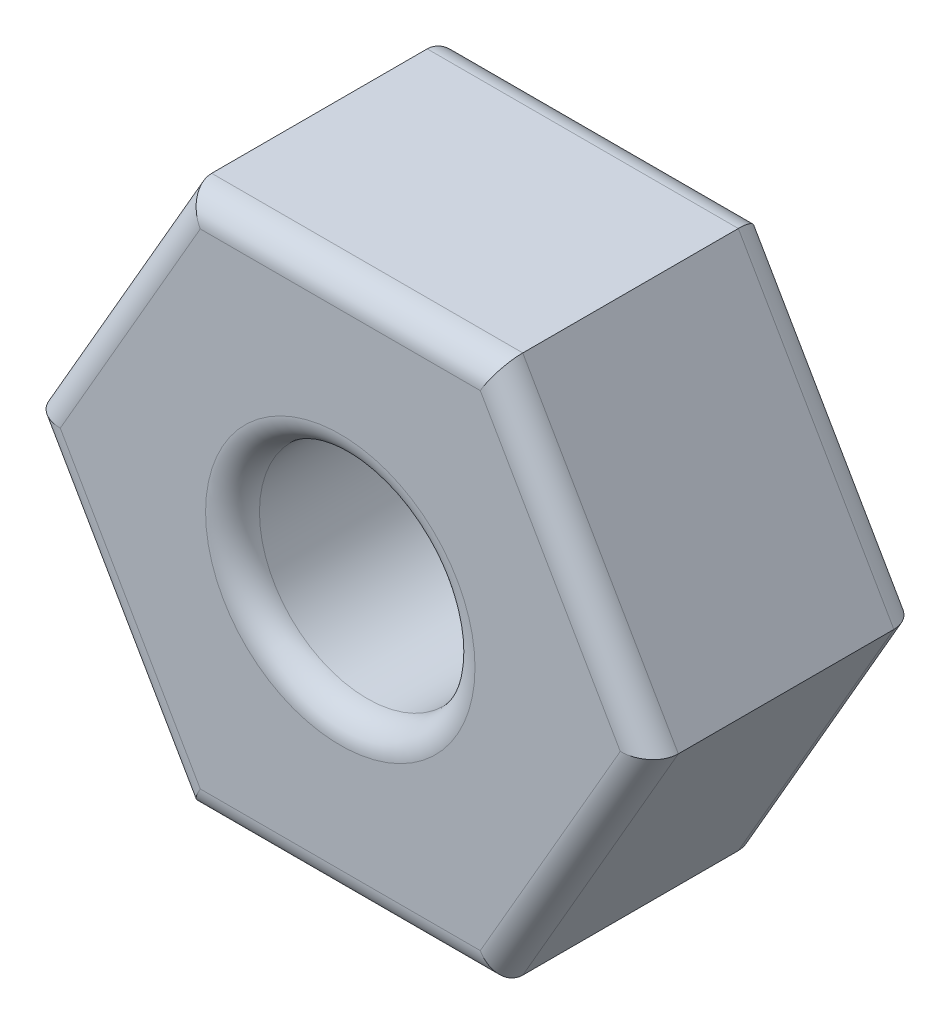
ISO-10303-21;
HEADER;
FILE_DESCRIPTION(('STEP AP214'),'2;1');
FILE_NAME('part.step','',(''),(''),'','','');
FILE_SCHEMA(('AUTOMOTIVE_DESIGN { 1 0 10303 214 1 1 1 1 }'));
ENDSEC;
DATA;
#1=APPLICATION_CONTEXT('core data for automotive mechanical design processes');
#2=APPLICATION_PROTOCOL_DEFINITION('international standard','automotive_design',2000,#1);
#3=PRODUCT_CONTEXT('',#1,'mechanical');
#4=PRODUCT('Part','Part','',(#3));
#5=PRODUCT_RELATED_PRODUCT_CATEGORY('part','',(#4));
#6=PRODUCT_DEFINITION_FORMATION('','',#4);
#7=PRODUCT_DEFINITION_CONTEXT('part definition',#1,'design');
#8=PRODUCT_DEFINITION('design','',#6,#7);
#9=PRODUCT_DEFINITION_SHAPE('','',#8);
#10=(LENGTH_UNIT() NAMED_UNIT(*) SI_UNIT(.MILLI.,.METRE.));
#11=(NAMED_UNIT(*) PLANE_ANGLE_UNIT() SI_UNIT($,.RADIAN.));
#12=(NAMED_UNIT(*) SI_UNIT($,.STERADIAN.) SOLID_ANGLE_UNIT());
#13=UNCERTAINTY_MEASURE_WITH_UNIT(LENGTH_MEASURE(1.E-05),#10,'distance_accuracy_value','');
#14=(GEOMETRIC_REPRESENTATION_CONTEXT(3) GLOBAL_UNCERTAINTY_ASSIGNED_CONTEXT((#13)) GLOBAL_UNIT_ASSIGNED_CONTEXT((#10,
#11,#12)) REPRESENTATION_CONTEXT('',''));
#15=CARTESIAN_POINT('',(0.,0.,0.));
#16=DIRECTION('',(0.,0.,1.));
#17=DIRECTION('',(1.,0.,0.));
#18=AXIS2_PLACEMENT_3D('',#15,#16,#17);
#19=CARTESIAN_POINT('',(0.,0.,2.));
#20=DIRECTION('',(0.,0.,1.));
#21=DIRECTION('',(1.,0.,0.));
#22=AXIS2_PLACEMENT_3D('',#19,#20,#21);
#23=PLANE('',#22);
#24=CARTESIAN_POINT('',(0.,0.,2.));
#25=DIRECTION('',(0.,0.,1.));
#26=DIRECTION('',(1.,0.,0.));
#27=AXIS2_PLACEMENT_3D('',#24,#25,#26);
#28=CIRCLE('',#27,1.);
#29=CARTESIAN_POINT('',(1.,0.,2.));
#30=VERTEX_POINT('',#29);
#31=EDGE_CURVE('E11',#30,#30,#28,.F.);
#32=ORIENTED_EDGE('',*,*,#31,.T.);
#33=EDGE_LOOP('',(#32));
#34=FACE_BOUND('',#33,.T.);
#35=DIRECTION('',(0.5,-0.866025403784439,0.));
#36=VECTOR('',#35,1.);
#37=CARTESIAN_POINT('',(-0.981495457622361,-1.9,2.));
#38=LINE('',#37,#36);
#39=CARTESIAN_POINT('',(-2.07846096908265,0.,2.));
#40=VERTEX_POINT('',#39);
#41=CARTESIAN_POINT('',(-1.03923048454132,-1.8,2.));
#42=VERTEX_POINT('',#41);
#43=EDGE_CURVE('E52',#40,#42,#38,.T.);
#44=ORIENTED_EDGE('',*,*,#43,.T.);
#45=DIRECTION('',(1.,0.,0.));
#46=VECTOR('',#45,1.);
#47=CARTESIAN_POINT('',(1.15470053837925,-1.8,2.));
#48=LINE('',#47,#46);
#49=CARTESIAN_POINT('',(1.03923048454133,-1.8,2.));
#50=VERTEX_POINT('',#49);
#51=EDGE_CURVE('E44',#42,#50,#48,.T.);
#52=ORIENTED_EDGE('',*,*,#51,.T.);
#53=DIRECTION('',(0.499999999999999,0.866025403784439,0.));
#54=VECTOR('',#53,1.);
#55=CARTESIAN_POINT('',(2.13619599600162,0.100000000000002,2.));
#56=LINE('',#55,#54);
#57=CARTESIAN_POINT('',(2.07846096908265,0.,2.));
#58=VERTEX_POINT('',#57);
#59=EDGE_CURVE('E191',#50,#58,#56,.T.);
#60=ORIENTED_EDGE('',*,*,#59,.T.);
#61=DIRECTION('',(-0.5,0.866025403784439,0.));
#62=VECTOR('',#61,1.);
#63=CARTESIAN_POINT('',(0.981495457622363,1.9,2.));
#64=LINE('',#63,#62);
#65=CARTESIAN_POINT('',(1.03923048454133,1.8,2.));
#66=VERTEX_POINT('',#65);
#67=EDGE_CURVE('E193',#58,#66,#64,.T.);
#68=ORIENTED_EDGE('',*,*,#67,.T.);
#69=DIRECTION('',(-1.,0.,0.));
#70=VECTOR('',#69,1.);
#71=CARTESIAN_POINT('',(-1.15470053837925,1.8,2.));
#72=LINE('',#71,#70);
#73=CARTESIAN_POINT('',(-1.03923048454133,1.8,2.));
#74=VERTEX_POINT('',#73);
#75=EDGE_CURVE('E195',#66,#74,#72,.T.);
#76=ORIENTED_EDGE('',*,*,#75,.T.);
#77=DIRECTION('',(-0.5,-0.866025403784439,0.));
#78=VECTOR('',#77,1.);
#79=CARTESIAN_POINT('',(-2.13619599600161,-0.100000000000001,2.));
#80=LINE('',#79,#78);
#81=EDGE_CURVE('E57',#74,#40,#80,.T.);
#82=ORIENTED_EDGE('',*,*,#81,.T.);
#83=EDGE_LOOP('',(#44,#52,#60,#68,#76,#82));
#84=FACE_BOUND('',#83,.T.);
#85=ADVANCED_FACE('F35',(#34,#84),#23,.T.);
#86=CARTESIAN_POINT('',(0.,0.,0.));
#87=DIRECTION('',(0.,0.,1.));
#88=DIRECTION('',(1.,0.,0.));
#89=AXIS2_PLACEMENT_3D('',#86,#87,#88);
#90=PLANE('',#89);
#91=CARTESIAN_POINT('',(0.,0.,0.));
#92=DIRECTION('',(0.,0.,1.));
#93=DIRECTION('',(1.,0.,0.));
#94=AXIS2_PLACEMENT_3D('',#91,#92,#93);
#95=CIRCLE('',#94,1.);
#96=CARTESIAN_POINT('',(1.,0.,0.));
#97=VERTEX_POINT('',#96);
#98=EDGE_CURVE('E153',#97,#97,#95,.T.);
#99=ORIENTED_EDGE('',*,*,#98,.T.);
#100=EDGE_LOOP('',(#99));
#101=FACE_BOUND('',#100,.T.);
#102=DIRECTION('',(-1.,0.,0.));
#103=VECTOR('',#102,1.);
#104=CARTESIAN_POINT('',(0.,1.8,0.));
#105=LINE('',#104,#103);
#106=CARTESIAN_POINT('',(-1.03923048454133,1.8,0.));
#107=VERTEX_POINT('',#106);
#108=CARTESIAN_POINT('',(1.03923048454133,1.8,0.));
#109=VERTEX_POINT('',#108);
#110=EDGE_CURVE('E152',#107,#109,#105,.F.);
#111=ORIENTED_EDGE('',*,*,#110,.T.);
#112=DIRECTION('',(-0.5,0.866025403784439,0.));
#113=VECTOR('',#112,1.);
#114=CARTESIAN_POINT('',(1.55884572681199,0.900000000000001,0.));
#115=LINE('',#114,#113);
#116=CARTESIAN_POINT('',(2.07846096908265,0.,0.));
#117=VERTEX_POINT('',#116);
#118=EDGE_CURVE('E131',#109,#117,#115,.F.);
#119=ORIENTED_EDGE('',*,*,#118,.T.);
#120=DIRECTION('',(0.499999999999999,0.866025403784439,0.));
#121=VECTOR('',#120,1.);
#122=CARTESIAN_POINT('',(1.55884572681199,-0.899999999999999,0.));
#123=LINE('',#122,#121);
#124=CARTESIAN_POINT('',(1.03923048454133,-1.8,0.));
#125=VERTEX_POINT('',#124);
#126=EDGE_CURVE('E141',#117,#125,#123,.F.);
#127=ORIENTED_EDGE('',*,*,#126,.T.);
#128=DIRECTION('',(1.,0.,0.));
#129=VECTOR('',#128,1.);
#130=CARTESIAN_POINT('',(0.,-1.8,0.));
#131=LINE('',#130,#129);
#132=CARTESIAN_POINT('',(-1.03923048454132,-1.8,0.));
#133=VERTEX_POINT('',#132);
#134=EDGE_CURVE('E147',#125,#133,#131,.F.);
#135=ORIENTED_EDGE('',*,*,#134,.T.);
#136=DIRECTION('',(0.5,-0.866025403784439,0.));
#137=VECTOR('',#136,1.);
#138=CARTESIAN_POINT('',(-1.55884572681199,-0.9,0.));
#139=LINE('',#138,#137);
#140=CARTESIAN_POINT('',(-2.07846096908265,0.,0.));
#141=VERTEX_POINT('',#140);
#142=EDGE_CURVE('E253',#133,#141,#139,.F.);
#143=ORIENTED_EDGE('',*,*,#142,.T.);
#144=DIRECTION('',(-0.5,-0.866025403784439,0.));
#145=VECTOR('',#144,1.);
#146=CARTESIAN_POINT('',(-1.55884572681199,0.899999999999998,0.));
#147=LINE('',#146,#145);
#148=EDGE_CURVE('E158',#141,#107,#147,.F.);
#149=ORIENTED_EDGE('',*,*,#148,.T.);
#150=EDGE_LOOP('',(#111,#119,#127,#135,#143,#149));
#151=FACE_BOUND('',#150,.T.);
#152=ADVANCED_FACE('F150',(#101,#151),#90,.F.);
#153=CARTESIAN_POINT('',(1.15470053837925,-2.,2.));
#154=DIRECTION('',(-0.866025403784439,0.5,0.));
#155=DIRECTION('',(-0.499999999999999,-0.866025403784439,0.));
#156=AXIS2_PLACEMENT_3D('',#153,#154,#155);
#157=PLANE('',#156);
#158=DIRECTION('',(0.,0.,-1.));
#159=VECTOR('',#158,1.);
#160=CARTESIAN_POINT('',(1.15470053837925,-2.,2.));
#161=LINE('',#160,#159);
#162=CARTESIAN_POINT('',(1.15470053837925,-2.,1.8));
#163=VERTEX_POINT('',#162);
#164=CARTESIAN_POINT('',(1.15470053837925,-2.,0.2));
#165=VERTEX_POINT('',#164);
#166=EDGE_CURVE('E210',#163,#165,#161,.T.);
#167=ORIENTED_EDGE('',*,*,#166,.T.);
#168=DIRECTION('',(0.499999999999999,0.866025403784439,0.));
#169=VECTOR('',#168,1.);
#170=CARTESIAN_POINT('',(1.15470053837925,-2.,0.2));
#171=LINE('',#170,#169);
#172=CARTESIAN_POINT('',(2.3094010767585,0.,0.2));
#173=VERTEX_POINT('',#172);
#174=EDGE_CURVE('E189',#165,#173,#171,.T.);
#175=ORIENTED_EDGE('',*,*,#174,.T.);
#176=DIRECTION('',(0.,0.,-1.));
#177=VECTOR('',#176,1.);
#178=CARTESIAN_POINT('',(2.3094010767585,0.,2.));
#179=LINE('',#178,#177);
#180=CARTESIAN_POINT('',(2.3094010767585,0.,1.8));
#181=VERTEX_POINT('',#180);
#182=EDGE_CURVE('E148',#181,#173,#179,.T.);
#183=ORIENTED_EDGE('',*,*,#182,.F.);
#184=DIRECTION('',(0.499999999999999,0.866025403784439,0.));
#185=VECTOR('',#184,1.);
#186=CARTESIAN_POINT('',(1.15470053837925,-2.,1.8));
#187=LINE('',#186,#185);
#188=EDGE_CURVE('E187',#181,#163,#187,.F.);
#189=ORIENTED_EDGE('',*,*,#188,.T.);
#190=EDGE_LOOP('',(#167,#175,#183,#189));
#191=FACE_BOUND('',#190,.T.);
#192=ADVANCED_FACE('F277',(#191),#157,.F.);
#193=CARTESIAN_POINT('',(2.3094010767585,0.,2.));
#194=DIRECTION('',(-0.866025403784438,-0.5,0.));
#195=DIRECTION('',(0.5,-0.866025403784439,0.));
#196=AXIS2_PLACEMENT_3D('',#193,#194,#195);
#197=PLANE('',#196);
#198=ORIENTED_EDGE('',*,*,#182,.T.);
#199=DIRECTION('',(-0.5,0.866025403784439,0.));
#200=VECTOR('',#199,1.);
#201=CARTESIAN_POINT('',(2.3094010767585,0.,0.2));
#202=LINE('',#201,#200);
#203=CARTESIAN_POINT('',(1.15470053837925,2.,0.2));
#204=VERTEX_POINT('',#203);
#205=EDGE_CURVE('E134',#173,#204,#202,.T.);
#206=ORIENTED_EDGE('',*,*,#205,.T.);
#207=DIRECTION('',(0.,0.,-1.));
#208=VECTOR('',#207,1.);
#209=CARTESIAN_POINT('',(1.15470053837925,2.,2.));
#210=LINE('',#209,#208);
#211=CARTESIAN_POINT('',(1.15470053837925,2.,1.8));
#212=VERTEX_POINT('',#211);
#213=EDGE_CURVE('E239',#212,#204,#210,.T.);
#214=ORIENTED_EDGE('',*,*,#213,.F.);
#215=DIRECTION('',(-0.5,0.866025403784439,0.));
#216=VECTOR('',#215,1.);
#217=CARTESIAN_POINT('',(2.3094010767585,0.,1.8));
#218=LINE('',#217,#216);
#219=EDGE_CURVE('E167',#212,#181,#218,.F.);
#220=ORIENTED_EDGE('',*,*,#219,.T.);
#221=EDGE_LOOP('',(#198,#206,#214,#220));
#222=FACE_BOUND('',#221,.T.);
#223=ADVANCED_FACE('F244',(#222),#197,.F.);
#224=CARTESIAN_POINT('',(1.15470053837925,2.,2.));
#225=DIRECTION('',(0.,-1.,0.));
#226=DIRECTION('',(1.,0.,0.));
#227=AXIS2_PLACEMENT_3D('',#224,#225,#226);
#228=PLANE('',#227);
#229=ORIENTED_EDGE('',*,*,#213,.T.);
#230=DIRECTION('',(-1.,0.,0.));
#231=VECTOR('',#230,1.);
#232=CARTESIAN_POINT('',(1.15470053837925,2.,0.2));
#233=LINE('',#232,#231);
#234=CARTESIAN_POINT('',(-1.15470053837925,2.,0.2));
#235=VERTEX_POINT('',#234);
#236=EDGE_CURVE('E172',#204,#235,#233,.T.);
#237=ORIENTED_EDGE('',*,*,#236,.T.);
#238=DIRECTION('',(0.,0.,-1.));
#239=VECTOR('',#238,1.);
#240=CARTESIAN_POINT('',(-1.15470053837925,2.,2.));
#241=LINE('',#240,#239);
#242=CARTESIAN_POINT('',(-1.15470053837925,2.,1.8));
#243=VERTEX_POINT('',#242);
#244=EDGE_CURVE('E241',#243,#235,#241,.T.);
#245=ORIENTED_EDGE('',*,*,#244,.F.);
#246=DIRECTION('',(-1.,0.,0.));
#247=VECTOR('',#246,1.);
#248=CARTESIAN_POINT('',(1.15470053837925,2.,1.8));
#249=LINE('',#248,#247);
#250=EDGE_CURVE('E170',#243,#212,#249,.F.);
#251=ORIENTED_EDGE('',*,*,#250,.T.);
#252=EDGE_LOOP('',(#229,#237,#245,#251));
#253=FACE_BOUND('',#252,.T.);
#254=ADVANCED_FACE('F238',(#253),#228,.F.);
#255=CARTESIAN_POINT('',(-1.15470053837925,2.,2.));
#256=DIRECTION('',(0.866025403784439,-0.499999999999999,0.));
#257=DIRECTION('',(0.5,0.866025403784439,0.));
#258=AXIS2_PLACEMENT_3D('',#255,#256,#257);
#259=PLANE('',#258);
#260=ORIENTED_EDGE('',*,*,#244,.T.);
#261=DIRECTION('',(-0.5,-0.866025403784439,0.));
#262=VECTOR('',#261,1.);
#263=CARTESIAN_POINT('',(-1.15470053837925,2.,0.2));
#264=LINE('',#263,#262);
#265=CARTESIAN_POINT('',(-2.3094010767585,0.,0.2));
#266=VERTEX_POINT('',#265);
#267=EDGE_CURVE('E176',#235,#266,#264,.T.);
#268=ORIENTED_EDGE('',*,*,#267,.T.);
#269=DIRECTION('',(0.,0.,-1.));
#270=VECTOR('',#269,1.);
#271=CARTESIAN_POINT('',(-2.3094010767585,0.,2.));
#272=LINE('',#271,#270);
#273=CARTESIAN_POINT('',(-2.3094010767585,0.,1.8));
#274=VERTEX_POINT('',#273);
#275=EDGE_CURVE('E248',#274,#266,#272,.T.);
#276=ORIENTED_EDGE('',*,*,#275,.F.);
#277=DIRECTION('',(-0.5,-0.866025403784439,0.));
#278=VECTOR('',#277,1.);
#279=CARTESIAN_POINT('',(-1.15470053837925,2.,1.8));
#280=LINE('',#279,#278);
#281=EDGE_CURVE('E174',#274,#243,#280,.F.);
#282=ORIENTED_EDGE('',*,*,#281,.T.);
#283=EDGE_LOOP('',(#260,#268,#276,#282));
#284=FACE_BOUND('',#283,.T.);
#285=ADVANCED_FACE('F265',(#284),#259,.F.);
#286=CARTESIAN_POINT('',(-2.3094010767585,0.,2.));
#287=DIRECTION('',(0.866025403784438,0.5,0.));
#288=DIRECTION('',(-0.5,0.866025403784439,0.));
#289=AXIS2_PLACEMENT_3D('',#286,#287,#288);
#290=PLANE('',#289);
#291=ORIENTED_EDGE('',*,*,#275,.T.);
#292=DIRECTION('',(0.5,-0.866025403784439,0.));
#293=VECTOR('',#292,1.);
#294=CARTESIAN_POINT('',(-2.3094010767585,0.,0.2));
#295=LINE('',#294,#293);
#296=CARTESIAN_POINT('',(-1.15470053837925,-2.,0.2));
#297=VERTEX_POINT('',#296);
#298=EDGE_CURVE('E180',#266,#297,#295,.T.);
#299=ORIENTED_EDGE('',*,*,#298,.T.);
#300=DIRECTION('',(0.,0.,-1.));
#301=VECTOR('',#300,1.);
#302=CARTESIAN_POINT('',(-1.15470053837925,-2.,2.));
#303=LINE('',#302,#301);
#304=CARTESIAN_POINT('',(-1.15470053837925,-2.,1.8));
#305=VERTEX_POINT('',#304);
#306=EDGE_CURVE('E270',#305,#297,#303,.T.);
#307=ORIENTED_EDGE('',*,*,#306,.F.);
#308=DIRECTION('',(0.5,-0.866025403784439,0.));
#309=VECTOR('',#308,1.);
#310=CARTESIAN_POINT('',(-2.3094010767585,0.,1.8));
#311=LINE('',#310,#309);
#312=EDGE_CURVE('E178',#305,#274,#311,.F.);
#313=ORIENTED_EDGE('',*,*,#312,.T.);
#314=EDGE_LOOP('',(#291,#299,#307,#313));
#315=FACE_BOUND('',#314,.T.);
#316=ADVANCED_FACE('F288',(#315),#290,.F.);
#317=CARTESIAN_POINT('',(-1.15470053837925,-2.,2.));
#318=DIRECTION('',(0.,1.,0.));
#319=DIRECTION('',(-1.,0.,0.));
#320=AXIS2_PLACEMENT_3D('',#317,#318,#319);
#321=PLANE('',#320);
#322=ORIENTED_EDGE('',*,*,#306,.T.);
#323=DIRECTION('',(1.,0.,0.));
#324=VECTOR('',#323,1.);
#325=CARTESIAN_POINT('',(-1.15470053837925,-2.,0.2));
#326=LINE('',#325,#324);
#327=EDGE_CURVE('E185',#297,#165,#326,.T.);
#328=ORIENTED_EDGE('',*,*,#327,.T.);
#329=ORIENTED_EDGE('',*,*,#166,.F.);
#330=DIRECTION('',(1.,0.,0.));
#331=VECTOR('',#330,1.);
#332=CARTESIAN_POINT('',(-1.15470053837925,-2.,1.8));
#333=LINE('',#332,#331);
#334=EDGE_CURVE('E182',#163,#305,#333,.F.);
#335=ORIENTED_EDGE('',*,*,#334,.T.);
#336=EDGE_LOOP('',(#322,#328,#329,#335));
#337=FACE_BOUND('',#336,.T.);
#338=ADVANCED_FACE('F289',(#337),#321,.F.);
#339=CARTESIAN_POINT('',(0.,0.,2.));
#340=DIRECTION('',(0.,0.,-1.));
#341=DIRECTION('',(-1.,0.,0.));
#342=AXIS2_PLACEMENT_3D('',#339,#340,#341);
#343=CYLINDRICAL_SURFACE('',#342,0.8);
#344=CARTESIAN_POINT('',(0.,0.,0.2));
#345=DIRECTION('',(0.,0.,1.));
#346=DIRECTION('',(1.,0.,0.));
#347=AXIS2_PLACEMENT_3D('',#344,#345,#346);
#348=CIRCLE('',#347,0.8);
#349=CARTESIAN_POINT('',(0.8,0.,0.2));
#350=VERTEX_POINT('',#349);
#351=EDGE_CURVE('E164',#350,#350,#348,.F.);
#352=ORIENTED_EDGE('',*,*,#351,.T.);
#353=EDGE_LOOP('',(#352));
#354=FACE_BOUND('',#353,.T.);
#355=CARTESIAN_POINT('',(0.,0.,1.8));
#356=DIRECTION('',(0.,0.,1.));
#357=DIRECTION('',(1.,0.,0.));
#358=AXIS2_PLACEMENT_3D('',#355,#356,#357);
#359=CIRCLE('',#358,0.8);
#360=CARTESIAN_POINT('',(0.8,0.,1.8));
#361=VERTEX_POINT('',#360);
#362=EDGE_CURVE('E156',#361,#361,#359,.T.);
#363=ORIENTED_EDGE('',*,*,#362,.T.);
#364=EDGE_LOOP('',(#363));
#365=FACE_BOUND('',#364,.T.);
#366=ADVANCED_FACE('F308',(#354,#365),#343,.F.);
#367=CARTESIAN_POINT('',(0.,0.,0.2));
#368=DIRECTION('',(0.,0.,1.));
#369=DIRECTION('',(1.,0.,0.));
#370=AXIS2_PLACEMENT_3D('',#367,#368,#369);
#371=TOROIDAL_SURFACE('',#370,1.,0.2);
#372=ORIENTED_EDGE('',*,*,#351,.F.);
#373=EDGE_LOOP('',(#372));
#374=FACE_BOUND('',#373,.T.);
#375=ORIENTED_EDGE('',*,*,#98,.F.);
#376=EDGE_LOOP('',(#375));
#377=FACE_BOUND('',#376,.T.);
#378=ADVANCED_FACE('F322',(#374,#377),#371,.T.);
#379=CARTESIAN_POINT('',(-2.13619599600161,0.0999999999999992,0.2));
#380=DIRECTION('',(0.5,-0.866025403784439,0.));
#381=DIRECTION('',(0.866025403784438,0.5,0.));
#382=AXIS2_PLACEMENT_3D('',#379,#380,#381);
#383=CYLINDRICAL_SURFACE('',#382,0.2);
#384=CARTESIAN_POINT('',(-2.07846096908265,0.,0.2));
#385=DIRECTION('',(0.,-1.,0.));
#386=DIRECTION('',(1.,0.,0.));
#387=AXIS2_PLACEMENT_3D('',#384,#385,#386);
#388=ELLIPSE('',#387,0.23094010767585,0.2);
#389=EDGE_CURVE('E204',#141,#266,#388,.F.);
#390=ORIENTED_EDGE('',*,*,#389,.F.);
#391=ORIENTED_EDGE('',*,*,#142,.F.);
#392=CARTESIAN_POINT('',(-1.03923048454132,-1.8,0.2));
#393=DIRECTION('',(0.866025403784439,-0.5,0.));
#394=DIRECTION('',(0.5,0.866025403784439,0.));
#395=AXIS2_PLACEMENT_3D('',#392,#393,#394);
#396=ELLIPSE('',#395,0.23094010767585,0.2);
#397=EDGE_CURVE('E207',#297,#133,#396,.T.);
#398=ORIENTED_EDGE('',*,*,#397,.F.);
#399=ORIENTED_EDGE('',*,*,#298,.F.);
#400=EDGE_LOOP('',(#390,#391,#398,#399));
#401=FACE_BOUND('',#400,.T.);
#402=ADVANCED_FACE('F286',(#401),#383,.T.);
#403=CARTESIAN_POINT('',(-1.15470053837925,-1.8,0.2));
#404=DIRECTION('',(1.,0.,0.));
#405=DIRECTION('',(0.,1.,0.));
#406=AXIS2_PLACEMENT_3D('',#403,#404,#405);
#407=CYLINDRICAL_SURFACE('',#406,0.2);
#408=ORIENTED_EDGE('',*,*,#397,.T.);
#409=ORIENTED_EDGE('',*,*,#134,.F.);
#410=CARTESIAN_POINT('',(1.03923048454133,-1.8,0.2));
#411=DIRECTION('',(0.866025403784438,0.5,0.));
#412=DIRECTION('',(-0.5,0.866025403784438,0.));
#413=AXIS2_PLACEMENT_3D('',#410,#411,#412);
#414=ELLIPSE('',#413,0.23094010767585,0.2);
#415=EDGE_CURVE('E144',#165,#125,#414,.T.);
#416=ORIENTED_EDGE('',*,*,#415,.F.);
#417=ORIENTED_EDGE('',*,*,#327,.F.);
#418=EDGE_LOOP('',(#408,#409,#416,#417));
#419=FACE_BOUND('',#418,.T.);
#420=ADVANCED_FACE('F283',(#419),#407,.T.);
#421=CARTESIAN_POINT('',(-0.981495457622363,1.9,0.2));
#422=DIRECTION('',(-0.5,-0.866025403784439,0.));
#423=DIRECTION('',(0.866025403784439,-0.499999999999999,0.));
#424=AXIS2_PLACEMENT_3D('',#421,#422,#423);
#425=CYLINDRICAL_SURFACE('',#424,0.2);
#426=ORIENTED_EDGE('',*,*,#389,.T.);
#427=ORIENTED_EDGE('',*,*,#267,.F.);
#428=CARTESIAN_POINT('',(-1.03923048454133,1.8,0.2));
#429=DIRECTION('',(-0.866025403784438,-0.500000000000001,0.));
#430=DIRECTION('',(0.5,-0.866025403784438,0.));
#431=AXIS2_PLACEMENT_3D('',#428,#429,#430);
#432=ELLIPSE('',#431,0.23094010767585,0.2);
#433=EDGE_CURVE('E137',#107,#235,#432,.F.);
#434=ORIENTED_EDGE('',*,*,#433,.F.);
#435=ORIENTED_EDGE('',*,*,#148,.F.);
#436=EDGE_LOOP('',(#426,#427,#434,#435));
#437=FACE_BOUND('',#436,.T.);
#438=ADVANCED_FACE('F260',(#437),#425,.T.);
#439=CARTESIAN_POINT('',(0.981495457622364,-1.9,0.2));
#440=DIRECTION('',(0.499999999999999,0.866025403784439,0.));
#441=DIRECTION('',(-0.866025403784439,0.5,0.));
#442=AXIS2_PLACEMENT_3D('',#439,#440,#441);
#443=CYLINDRICAL_SURFACE('',#442,0.2);
#444=ORIENTED_EDGE('',*,*,#415,.T.);
#445=ORIENTED_EDGE('',*,*,#126,.F.);
#446=CARTESIAN_POINT('',(2.07846096908265,0.,0.2));
#447=DIRECTION('',(0.,1.,0.));
#448=DIRECTION('',(1.,0.,0.));
#449=AXIS2_PLACEMENT_3D('',#446,#447,#448);
#450=ELLIPSE('',#449,0.23094010767585,0.2);
#451=EDGE_CURVE('E127',#173,#117,#450,.T.);
#452=ORIENTED_EDGE('',*,*,#451,.F.);
#453=ORIENTED_EDGE('',*,*,#174,.F.);
#454=EDGE_LOOP('',(#444,#445,#452,#453));
#455=FACE_BOUND('',#454,.T.);
#456=ADVANCED_FACE('F142',(#455),#443,.T.);
#457=CARTESIAN_POINT('',(1.15470053837925,1.8,0.2));
#458=DIRECTION('',(-1.,0.,0.));
#459=DIRECTION('',(0.,-1.,0.));
#460=AXIS2_PLACEMENT_3D('',#457,#458,#459);
#461=CYLINDRICAL_SURFACE('',#460,0.2);
#462=ORIENTED_EDGE('',*,*,#433,.T.);
#463=ORIENTED_EDGE('',*,*,#236,.F.);
#464=CARTESIAN_POINT('',(1.03923048454133,1.8,0.2));
#465=DIRECTION('',(-0.866025403784439,0.5,0.));
#466=DIRECTION('',(-0.5,-0.866025403784439,0.));
#467=AXIS2_PLACEMENT_3D('',#464,#465,#466);
#468=ELLIPSE('',#467,0.23094010767585,0.2);
#469=EDGE_CURVE('E138',#109,#204,#468,.F.);
#470=ORIENTED_EDGE('',*,*,#469,.F.);
#471=ORIENTED_EDGE('',*,*,#110,.F.);
#472=EDGE_LOOP('',(#462,#463,#470,#471));
#473=FACE_BOUND('',#472,.T.);
#474=ADVANCED_FACE('F263',(#473),#461,.T.);
#475=CARTESIAN_POINT('',(2.13619599600162,-0.0999999999999979,0.2));
#476=DIRECTION('',(-0.5,0.866025403784439,0.));
#477=DIRECTION('',(-0.866025403784438,-0.5,0.));
#478=AXIS2_PLACEMENT_3D('',#475,#476,#477);
#479=CYLINDRICAL_SURFACE('',#478,0.2);
#480=ORIENTED_EDGE('',*,*,#451,.T.);
#481=ORIENTED_EDGE('',*,*,#118,.F.);
#482=ORIENTED_EDGE('',*,*,#469,.T.);
#483=ORIENTED_EDGE('',*,*,#205,.F.);
#484=EDGE_LOOP('',(#480,#481,#482,#483));
#485=FACE_BOUND('',#484,.T.);
#486=ADVANCED_FACE('F129',(#485),#479,.T.);
#487=CARTESIAN_POINT('',(0.,0.,1.8));
#488=DIRECTION('',(0.,0.,1.));
#489=DIRECTION('',(1.,0.,0.));
#490=AXIS2_PLACEMENT_3D('',#487,#488,#489);
#491=TOROIDAL_SURFACE('',#490,1.,0.2);
#492=ORIENTED_EDGE('',*,*,#31,.F.);
#493=EDGE_LOOP('',(#492));
#494=FACE_BOUND('',#493,.T.);
#495=ORIENTED_EDGE('',*,*,#362,.F.);
#496=EDGE_LOOP('',(#495));
#497=FACE_BOUND('',#496,.T.);
#498=ADVANCED_FACE('F328',(#494,#497),#491,.T.);
#499=CARTESIAN_POINT('',(0.,1.8,1.8));
#500=DIRECTION('',(1.,0.,0.));
#501=DIRECTION('',(0.,1.,0.));
#502=AXIS2_PLACEMENT_3D('',#499,#500,#501);
#503=CYLINDRICAL_SURFACE('',#502,0.2);
#504=CARTESIAN_POINT('',(1.03923048454133,1.8,1.8));
#505=DIRECTION('',(0.866025403784439,-0.5,0.));
#506=DIRECTION('',(-0.5,-0.866025403784439,0.));
#507=AXIS2_PLACEMENT_3D('',#504,#505,#506);
#508=ELLIPSE('',#507,0.23094010767585,0.2);
#509=EDGE_CURVE('E220',#212,#66,#508,.T.);
#510=ORIENTED_EDGE('',*,*,#509,.F.);
#511=ORIENTED_EDGE('',*,*,#250,.F.);
#512=CARTESIAN_POINT('',(-1.03923048454132,1.8,1.8));
#513=DIRECTION('',(0.866025403784438,0.500000000000001,0.));
#514=DIRECTION('',(0.5,-0.866025403784438,0.));
#515=AXIS2_PLACEMENT_3D('',#512,#513,#514);
#516=ELLIPSE('',#515,0.23094010767585,0.2);
#517=EDGE_CURVE('E39',#74,#243,#516,.F.);
#518=ORIENTED_EDGE('',*,*,#517,.F.);
#519=ORIENTED_EDGE('',*,*,#75,.F.);
#520=EDGE_LOOP('',(#510,#511,#518,#519));
#521=FACE_BOUND('',#520,.T.);
#522=ADVANCED_FACE('F37',(#521),#503,.T.);
#523=CARTESIAN_POINT('',(-1.55884572681199,0.899999999999998,1.8));
#524=DIRECTION('',(0.5,0.866025403784439,0.));
#525=DIRECTION('',(-0.866025403784439,0.499999999999999,0.));
#526=AXIS2_PLACEMENT_3D('',#523,#524,#525);
#527=CYLINDRICAL_SURFACE('',#526,0.2);
#528=ORIENTED_EDGE('',*,*,#517,.T.);
#529=ORIENTED_EDGE('',*,*,#281,.F.);
#530=CARTESIAN_POINT('',(-2.07846096908265,0.,1.8));
#531=DIRECTION('',(0.,1.,0.));
#532=DIRECTION('',(1.,0.,0.));
#533=AXIS2_PLACEMENT_3D('',#530,#531,#532);
#534=ELLIPSE('',#533,0.23094010767585,0.2);
#535=EDGE_CURVE('E218',#40,#274,#534,.F.);
#536=ORIENTED_EDGE('',*,*,#535,.F.);
#537=ORIENTED_EDGE('',*,*,#81,.F.);
#538=EDGE_LOOP('',(#528,#529,#536,#537));
#539=FACE_BOUND('',#538,.T.);
#540=ADVANCED_FACE('F230',(#539),#527,.T.);
#541=CARTESIAN_POINT('',(1.55884572681199,0.900000000000001,1.8));
#542=DIRECTION('',(0.5,-0.866025403784439,0.));
#543=DIRECTION('',(0.866025403784438,0.5,0.));
#544=AXIS2_PLACEMENT_3D('',#541,#542,#543);
#545=CYLINDRICAL_SURFACE('',#544,0.2);
#546=ORIENTED_EDGE('',*,*,#509,.T.);
#547=ORIENTED_EDGE('',*,*,#67,.F.);
#548=CARTESIAN_POINT('',(2.07846096908265,0.,1.8));
#549=DIRECTION('',(0.,-1.,0.));
#550=DIRECTION('',(-1.,0.,0.));
#551=AXIS2_PLACEMENT_3D('',#548,#549,#550);
#552=ELLIPSE('',#551,0.23094010767585,0.2);
#553=EDGE_CURVE('E215',#181,#58,#552,.T.);
#554=ORIENTED_EDGE('',*,*,#553,.F.);
#555=ORIENTED_EDGE('',*,*,#219,.F.);
#556=EDGE_LOOP('',(#546,#547,#554,#555));
#557=FACE_BOUND('',#556,.T.);
#558=ADVANCED_FACE('F349',(#557),#545,.T.);
#559=CARTESIAN_POINT('',(-1.55884572681199,-0.9,1.8));
#560=DIRECTION('',(-0.5,0.866025403784439,0.));
#561=DIRECTION('',(-0.866025403784438,-0.5,0.));
#562=AXIS2_PLACEMENT_3D('',#559,#560,#561);
#563=CYLINDRICAL_SURFACE('',#562,0.2);
#564=ORIENTED_EDGE('',*,*,#535,.T.);
#565=ORIENTED_EDGE('',*,*,#312,.F.);
#566=CARTESIAN_POINT('',(-1.03923048454132,-1.8,1.8));
#567=DIRECTION('',(-0.866025403784439,0.5,0.));
#568=DIRECTION('',(0.5,0.866025403784439,0.));
#569=AXIS2_PLACEMENT_3D('',#566,#567,#568);
#570=ELLIPSE('',#569,0.23094010767585,0.2);
#571=EDGE_CURVE('E213',#42,#305,#570,.F.);
#572=ORIENTED_EDGE('',*,*,#571,.F.);
#573=ORIENTED_EDGE('',*,*,#43,.F.);
#574=EDGE_LOOP('',(#564,#565,#572,#573));
#575=FACE_BOUND('',#574,.T.);
#576=ADVANCED_FACE('F346',(#575),#563,.T.);
#577=CARTESIAN_POINT('',(1.55884572681199,-0.899999999999999,1.8));
#578=DIRECTION('',(-0.499999999999999,-0.866025403784439,0.));
#579=DIRECTION('',(0.866025403784439,-0.5,0.));
#580=AXIS2_PLACEMENT_3D('',#577,#578,#579);
#581=CYLINDRICAL_SURFACE('',#580,0.2);
#582=ORIENTED_EDGE('',*,*,#553,.T.);
#583=ORIENTED_EDGE('',*,*,#59,.F.);
#584=CARTESIAN_POINT('',(1.03923048454133,-1.8,1.8));
#585=DIRECTION('',(-0.866025403784438,-0.5,0.));
#586=DIRECTION('',(0.5,-0.866025403784438,0.));
#587=AXIS2_PLACEMENT_3D('',#584,#585,#586);
#588=ELLIPSE('',#587,0.23094010767585,0.2);
#589=EDGE_CURVE('E211',#163,#50,#588,.T.);
#590=ORIENTED_EDGE('',*,*,#589,.F.);
#591=ORIENTED_EDGE('',*,*,#188,.F.);
#592=EDGE_LOOP('',(#582,#583,#590,#591));
#593=FACE_BOUND('',#592,.T.);
#594=ADVANCED_FACE('F297',(#593),#581,.T.);
#595=CARTESIAN_POINT('',(0.,-1.8,1.8));
#596=DIRECTION('',(-1.,0.,0.));
#597=DIRECTION('',(0.,-1.,0.));
#598=AXIS2_PLACEMENT_3D('',#595,#596,#597);
#599=CYLINDRICAL_SURFACE('',#598,0.2);
#600=ORIENTED_EDGE('',*,*,#571,.T.);
#601=ORIENTED_EDGE('',*,*,#334,.F.);
#602=ORIENTED_EDGE('',*,*,#589,.T.);
#603=ORIENTED_EDGE('',*,*,#51,.F.);
#604=EDGE_LOOP('',(#600,#601,#602,#603));
#605=FACE_BOUND('',#604,.T.);
#606=ADVANCED_FACE('F292',(#605),#599,.T.);
#607=CLOSED_SHELL('',(#85,#152,#192,#223,#254,#285,#316,#338,#366,#378,#402,#420,#438,#456,#474,
#486,#498,#522,#540,#558,#576,#594,#606));
#608=MANIFOLD_SOLID_BREP('B2',#607);
#609=ADVANCED_BREP_SHAPE_REPRESENTATION('',(#18,#608),#14);
#610=SHAPE_DEFINITION_REPRESENTATION(#9,#609);
ENDSEC;
END-ISO-10303-21;
